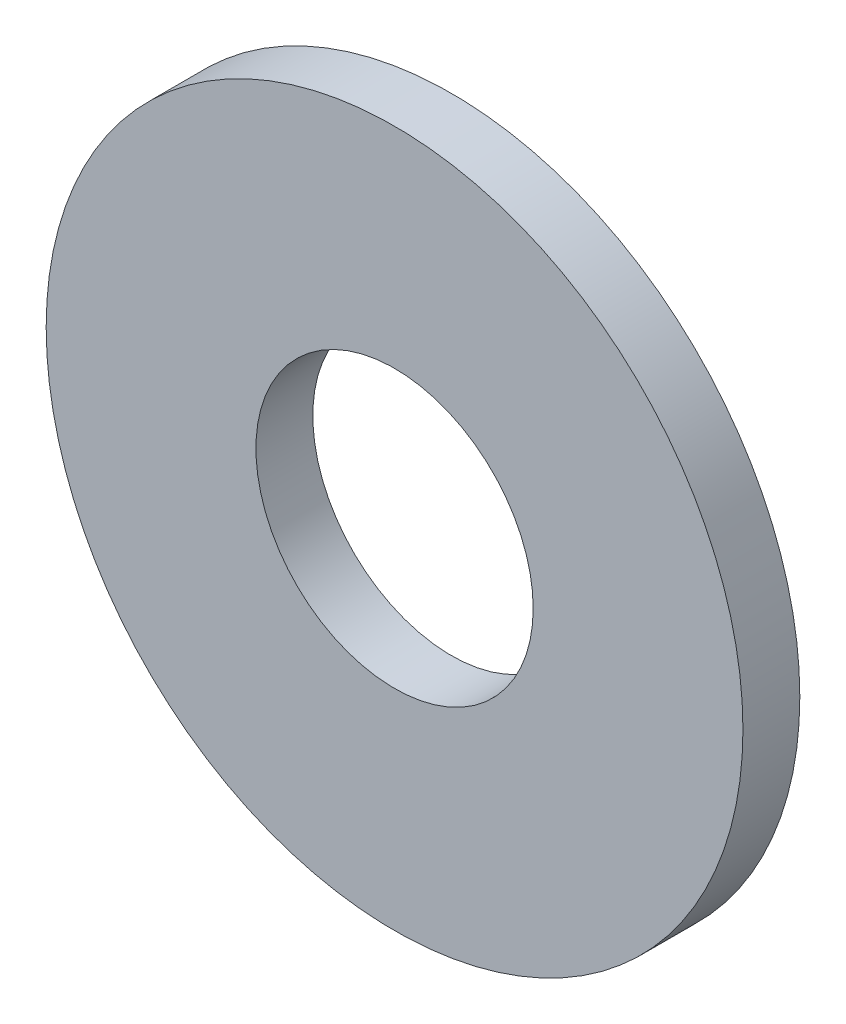
ISO-10303-21;
HEADER;
FILE_DESCRIPTION(('STEP AP214'),'2;1');
FILE_NAME('part.step','',(''),(''),'','','');
FILE_SCHEMA(('AUTOMOTIVE_DESIGN { 1 0 10303 214 1 1 1 1 }'));
ENDSEC;
DATA;
#1=APPLICATION_CONTEXT('core data for automotive mechanical design processes');
#2=APPLICATION_PROTOCOL_DEFINITION('international standard','automotive_design',2000,#1);
#3=PRODUCT_CONTEXT('',#1,'mechanical');
#4=PRODUCT('Part','Part','',(#3));
#5=PRODUCT_RELATED_PRODUCT_CATEGORY('part','',(#4));
#6=PRODUCT_DEFINITION_FORMATION('','',#4);
#7=PRODUCT_DEFINITION_CONTEXT('part definition',#1,'design');
#8=PRODUCT_DEFINITION('design','',#6,#7);
#9=PRODUCT_DEFINITION_SHAPE('','',#8);
#10=(LENGTH_UNIT() NAMED_UNIT(*) SI_UNIT(.MILLI.,.METRE.));
#11=(NAMED_UNIT(*) PLANE_ANGLE_UNIT() SI_UNIT($,.RADIAN.));
#12=(NAMED_UNIT(*) SI_UNIT($,.STERADIAN.) SOLID_ANGLE_UNIT());
#13=UNCERTAINTY_MEASURE_WITH_UNIT(LENGTH_MEASURE(1.E-05),#10,'distance_accuracy_value','');
#14=(GEOMETRIC_REPRESENTATION_CONTEXT(3) GLOBAL_UNCERTAINTY_ASSIGNED_CONTEXT((#13)) GLOBAL_UNIT_ASSIGNED_CONTEXT((#10,
#11,#12)) REPRESENTATION_CONTEXT('',''));
#15=CARTESIAN_POINT('',(0.,0.,0.));
#16=DIRECTION('',(0.,0.,1.));
#17=DIRECTION('',(1.,0.,0.));
#18=AXIS2_PLACEMENT_3D('',#15,#16,#17);
#19=CARTESIAN_POINT('',(0.,0.,0.4));
#20=DIRECTION('',(0.,0.,1.));
#21=DIRECTION('',(1.,0.,0.));
#22=AXIS2_PLACEMENT_3D('',#19,#20,#21);
#23=PLANE('',#22);
#24=CARTESIAN_POINT('',(0.,0.,0.4));
#25=DIRECTION('',(0.,0.,1.));
#26=DIRECTION('',(1.,0.,0.));
#27=AXIS2_PLACEMENT_3D('',#24,#25,#26);
#28=CIRCLE('',#27,2.45);
#29=CARTESIAN_POINT('',(2.45,0.,0.4));
#30=VERTEX_POINT('',#29);
#31=EDGE_CURVE('E10',#30,#30,#28,.T.);
#32=ORIENTED_EDGE('',*,*,#31,.T.);
#33=EDGE_LOOP('',(#32));
#34=FACE_BOUND('',#33,.T.);
#35=CARTESIAN_POINT('',(0.,0.,0.4));
#36=DIRECTION('',(0.,0.,1.));
#37=DIRECTION('',(1.,0.,0.));
#38=AXIS2_PLACEMENT_3D('',#35,#36,#37);
#39=CIRCLE('',#38,0.975);
#40=CARTESIAN_POINT('',(0.975,0.,0.4));
#41=VERTEX_POINT('',#40);
#42=EDGE_CURVE('E42',#41,#41,#39,.T.);
#43=ORIENTED_EDGE('',*,*,#42,.F.);
#44=EDGE_LOOP('',(#43));
#45=FACE_BOUND('',#44,.T.);
#46=ADVANCED_FACE('F31',(#34,#45),#23,.T.);
#47=CARTESIAN_POINT('',(0.,0.,0.));
#48=DIRECTION('',(0.,0.,1.));
#49=DIRECTION('',(1.,0.,0.));
#50=AXIS2_PLACEMENT_3D('',#47,#48,#49);
#51=PLANE('',#50);
#52=CARTESIAN_POINT('',(0.,0.,0.));
#53=DIRECTION('',(0.,0.,1.));
#54=DIRECTION('',(1.,0.,0.));
#55=AXIS2_PLACEMENT_3D('',#52,#53,#54);
#56=CIRCLE('',#55,2.45);
#57=CARTESIAN_POINT('',(2.45,0.,0.));
#58=VERTEX_POINT('',#57);
#59=EDGE_CURVE('E35',#58,#58,#56,.T.);
#60=ORIENTED_EDGE('',*,*,#59,.F.);
#61=EDGE_LOOP('',(#60));
#62=FACE_BOUND('',#61,.T.);
#63=CARTESIAN_POINT('',(0.,0.,0.));
#64=DIRECTION('',(0.,0.,1.));
#65=DIRECTION('',(1.,0.,0.));
#66=AXIS2_PLACEMENT_3D('',#63,#64,#65);
#67=CIRCLE('',#66,0.975);
#68=CARTESIAN_POINT('',(0.975,0.,0.));
#69=VERTEX_POINT('',#68);
#70=EDGE_CURVE('E44',#69,#69,#67,.T.);
#71=ORIENTED_EDGE('',*,*,#70,.T.);
#72=EDGE_LOOP('',(#71));
#73=FACE_BOUND('',#72,.T.);
#74=ADVANCED_FACE('F54',(#62,#73),#51,.F.);
#75=CARTESIAN_POINT('',(0.,0.,0.4));
#76=DIRECTION('',(0.,0.,-1.));
#77=DIRECTION('',(-1.,0.,0.));
#78=AXIS2_PLACEMENT_3D('',#75,#76,#77);
#79=CYLINDRICAL_SURFACE('',#78,2.45);
#80=ORIENTED_EDGE('',*,*,#31,.F.);
#81=EDGE_LOOP('',(#80));
#82=FACE_BOUND('',#81,.T.);
#83=ORIENTED_EDGE('',*,*,#59,.T.);
#84=EDGE_LOOP('',(#83));
#85=FACE_BOUND('',#84,.T.);
#86=ADVANCED_FACE('F33',(#82,#85),#79,.T.);
#87=CARTESIAN_POINT('',(0.,0.,0.4));
#88=DIRECTION('',(0.,0.,-1.));
#89=DIRECTION('',(-1.,0.,0.));
#90=AXIS2_PLACEMENT_3D('',#87,#88,#89);
#91=CYLINDRICAL_SURFACE('',#90,0.975);
#92=ORIENTED_EDGE('',*,*,#42,.T.);
#93=EDGE_LOOP('',(#92));
#94=FACE_BOUND('',#93,.T.);
#95=ORIENTED_EDGE('',*,*,#70,.F.);
#96=EDGE_LOOP('',(#95));
#97=FACE_BOUND('',#96,.T.);
#98=ADVANCED_FACE('F50',(#94,#97),#91,.F.);
#99=CLOSED_SHELL('',(#46,#74,#86,#98));
#100=MANIFOLD_SOLID_BREP('B2',#99);
#101=ADVANCED_BREP_SHAPE_REPRESENTATION('',(#18,#100),#14);
#102=SHAPE_DEFINITION_REPRESENTATION(#9,#101);
ENDSEC;
END-ISO-10303-21;
